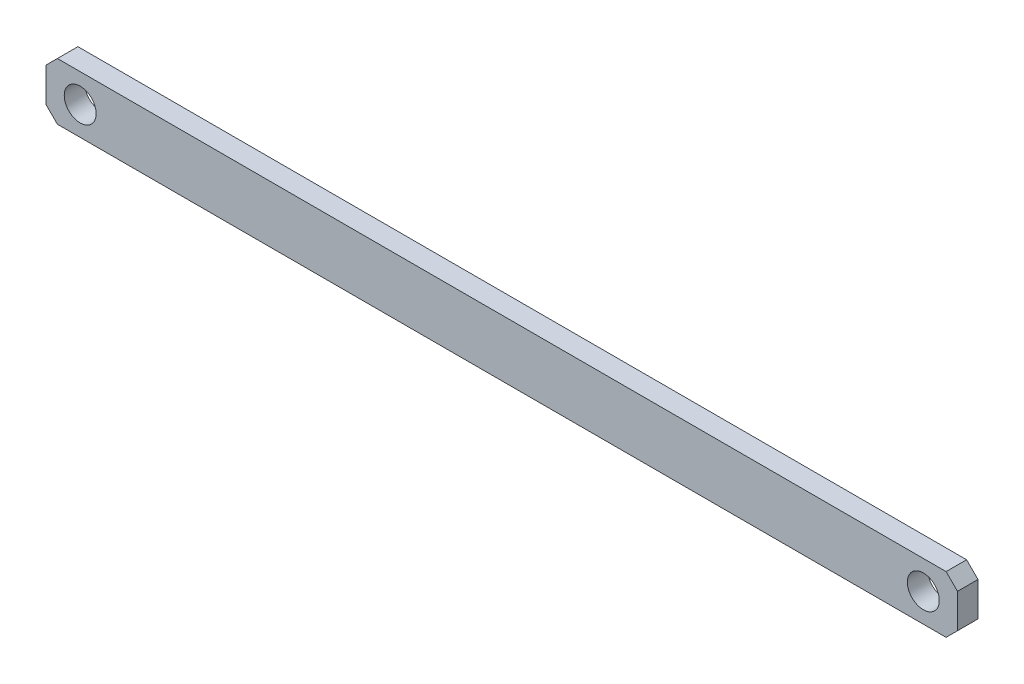
ISO-10303-21;
HEADER;
FILE_DESCRIPTION(('STEP AP214'),'2;1');
FILE_NAME('part.step','',(''),(''),'','','');
FILE_SCHEMA(('AUTOMOTIVE_DESIGN { 1 0 10303 214 1 1 1 1 }'));
ENDSEC;
DATA;
#1=APPLICATION_CONTEXT('core data for automotive mechanical design processes');
#2=APPLICATION_PROTOCOL_DEFINITION('international standard','automotive_design',2000,#1);
#3=PRODUCT_CONTEXT('',#1,'mechanical');
#4=PRODUCT('Part','Part','',(#3));
#5=PRODUCT_RELATED_PRODUCT_CATEGORY('part','',(#4));
#6=PRODUCT_DEFINITION_FORMATION('','',#4);
#7=PRODUCT_DEFINITION_CONTEXT('part definition',#1,'design');
#8=PRODUCT_DEFINITION('design','',#6,#7);
#9=PRODUCT_DEFINITION_SHAPE('','',#8);
#10=(LENGTH_UNIT() NAMED_UNIT(*) SI_UNIT(.MILLI.,.METRE.));
#11=(NAMED_UNIT(*) PLANE_ANGLE_UNIT() SI_UNIT($,.RADIAN.));
#12=(NAMED_UNIT(*) SI_UNIT($,.STERADIAN.) SOLID_ANGLE_UNIT());
#13=UNCERTAINTY_MEASURE_WITH_UNIT(LENGTH_MEASURE(1.E-05),#10,'distance_accuracy_value','');
#14=(GEOMETRIC_REPRESENTATION_CONTEXT(3) GLOBAL_UNCERTAINTY_ASSIGNED_CONTEXT((#13)) GLOBAL_UNIT_ASSIGNED_CONTEXT((#10,
#11,#12)) REPRESENTATION_CONTEXT('',''));
#15=CARTESIAN_POINT('',(0.,0.,0.));
#16=DIRECTION('',(0.,0.,1.));
#17=DIRECTION('',(1.,0.,0.));
#18=AXIS2_PLACEMENT_3D('',#15,#16,#17);
#19=CARTESIAN_POINT('',(0.,0.,4.5));
#20=DIRECTION('',(0.,0.,1.));
#21=DIRECTION('',(1.,0.,0.));
#22=AXIS2_PLACEMENT_3D('',#19,#20,#21);
#23=PLANE('',#22);
#24=CARTESIAN_POINT('',(185.,0.,4.5));
#25=DIRECTION('',(0.,0.,1.));
#26=DIRECTION('',(1.,0.,0.));
#27=AXIS2_PLACEMENT_3D('',#24,#25,#26);
#28=CIRCLE('',#27,7.00000000000001);
#29=CARTESIAN_POINT('',(192.,0.,4.5));
#30=VERTEX_POINT('',#29);
#31=EDGE_CURVE('E134',#30,#30,#28,.T.);
#32=ORIENTED_EDGE('',*,*,#31,.F.);
#33=EDGE_LOOP('',(#32));
#34=FACE_BOUND('',#33,.T.);
#35=DIRECTION('',(-1.,0.,0.));
#36=VECTOR('',#35,1.);
#37=CARTESIAN_POINT('',(-195.,12.5,4.5));
#38=LINE('',#37,#36);
#39=CARTESIAN_POINT('',(195.,12.5,4.5));
#40=VERTEX_POINT('',#39);
#41=CARTESIAN_POINT('',(-195.,12.5,4.5));
#42=VERTEX_POINT('',#41);
#43=EDGE_CURVE('E145',#40,#42,#38,.T.);
#44=ORIENTED_EDGE('',*,*,#43,.T.);
#45=DIRECTION('',(-0.707106781186548,-0.707106781186547,0.));
#46=VECTOR('',#45,1.);
#47=CARTESIAN_POINT('',(-200.,7.5,4.5));
#48=LINE('',#47,#46);
#49=CARTESIAN_POINT('',(-200.,7.5,4.5));
#50=VERTEX_POINT('',#49);
#51=EDGE_CURVE('E93',#42,#50,#48,.T.);
#52=ORIENTED_EDGE('',*,*,#51,.T.);
#53=DIRECTION('',(0.,-1.,0.));
#54=VECTOR('',#53,1.);
#55=CARTESIAN_POINT('',(-200.,-7.5,4.5));
#56=LINE('',#55,#54);
#57=CARTESIAN_POINT('',(-200.,-7.5,4.5));
#58=VERTEX_POINT('',#57);
#59=EDGE_CURVE('E160',#50,#58,#56,.T.);
#60=ORIENTED_EDGE('',*,*,#59,.T.);
#61=DIRECTION('',(0.707106781186548,-0.707106781186547,0.));
#62=VECTOR('',#61,1.);
#63=CARTESIAN_POINT('',(-195.,-12.5,4.5));
#64=LINE('',#63,#62);
#65=CARTESIAN_POINT('',(-195.,-12.5,4.5));
#66=VERTEX_POINT('',#65);
#67=EDGE_CURVE('E173',#58,#66,#64,.T.);
#68=ORIENTED_EDGE('',*,*,#67,.T.);
#69=DIRECTION('',(1.,0.,0.));
#70=VECTOR('',#69,1.);
#71=CARTESIAN_POINT('',(-195.,-12.5,4.5));
#72=LINE('',#71,#70);
#73=CARTESIAN_POINT('',(195.,-12.5,4.5));
#74=VERTEX_POINT('',#73);
#75=EDGE_CURVE('E112',#66,#74,#72,.T.);
#76=ORIENTED_EDGE('',*,*,#75,.T.);
#77=DIRECTION('',(0.707106781186548,0.707106781186547,0.));
#78=VECTOR('',#77,1.);
#79=CARTESIAN_POINT('',(195.,-12.5,4.5));
#80=LINE('',#79,#78);
#81=CARTESIAN_POINT('',(200.,-7.5,4.5));
#82=VERTEX_POINT('',#81);
#83=EDGE_CURVE('E106',#74,#82,#80,.T.);
#84=ORIENTED_EDGE('',*,*,#83,.T.);
#85=DIRECTION('',(0.,1.,0.));
#86=VECTOR('',#85,1.);
#87=CARTESIAN_POINT('',(200.,-7.5,4.5));
#88=LINE('',#87,#86);
#89=CARTESIAN_POINT('',(200.,7.5,4.5));
#90=VERTEX_POINT('',#89);
#91=EDGE_CURVE('E110',#82,#90,#88,.T.);
#92=ORIENTED_EDGE('',*,*,#91,.T.);
#93=DIRECTION('',(-0.707106781186548,0.707106781186547,0.));
#94=VECTOR('',#93,1.);
#95=CARTESIAN_POINT('',(195.,12.5,4.5));
#96=LINE('',#95,#94);
#97=EDGE_CURVE('E50',#90,#40,#96,.T.);
#98=ORIENTED_EDGE('',*,*,#97,.T.);
#99=EDGE_LOOP('',(#44,#52,#60,#68,#76,#84,#92,#98));
#100=FACE_BOUND('',#99,.T.);
#101=CARTESIAN_POINT('',(-185.,0.,4.5));
#102=DIRECTION('',(0.,0.,1.));
#103=DIRECTION('',(-1.,0.,0.));
#104=AXIS2_PLACEMENT_3D('',#101,#102,#103);
#105=CIRCLE('',#104,7.00000000000001);
#106=CARTESIAN_POINT('',(-192.,0.,4.5));
#107=VERTEX_POINT('',#106);
#108=EDGE_CURVE('E182',#107,#107,#105,.T.);
#109=ORIENTED_EDGE('',*,*,#108,.F.);
#110=EDGE_LOOP('',(#109));
#111=FACE_BOUND('',#110,.T.);
#112=ADVANCED_FACE('F33',(#34,#100,#111),#23,.T.);
#113=CARTESIAN_POINT('',(0.,0.,-4.5));
#114=DIRECTION('',(0.,0.,1.));
#115=DIRECTION('',(1.,0.,0.));
#116=AXIS2_PLACEMENT_3D('',#113,#114,#115);
#117=PLANE('',#116);
#118=DIRECTION('',(-1.,0.,0.));
#119=VECTOR('',#118,1.);
#120=CARTESIAN_POINT('',(-195.,12.5,-4.5));
#121=LINE('',#120,#119);
#122=CARTESIAN_POINT('',(195.,12.5,-4.5));
#123=VERTEX_POINT('',#122);
#124=CARTESIAN_POINT('',(-195.,12.5,-4.5));
#125=VERTEX_POINT('',#124);
#126=EDGE_CURVE('E130',#123,#125,#121,.T.);
#127=ORIENTED_EDGE('',*,*,#126,.F.);
#128=DIRECTION('',(-0.707106781186548,0.707106781186547,0.));
#129=VECTOR('',#128,1.);
#130=CARTESIAN_POINT('',(195.,12.5,-4.5));
#131=LINE('',#130,#129);
#132=CARTESIAN_POINT('',(200.,7.5,-4.5));
#133=VERTEX_POINT('',#132);
#134=EDGE_CURVE('E85',#133,#123,#131,.T.);
#135=ORIENTED_EDGE('',*,*,#134,.F.);
#136=DIRECTION('',(0.,1.,0.));
#137=VECTOR('',#136,1.);
#138=CARTESIAN_POINT('',(200.,-7.5,-4.5));
#139=LINE('',#138,#137);
#140=CARTESIAN_POINT('',(200.,-7.5,-4.5));
#141=VERTEX_POINT('',#140);
#142=EDGE_CURVE('E79',#141,#133,#139,.T.);
#143=ORIENTED_EDGE('',*,*,#142,.F.);
#144=DIRECTION('',(0.707106781186548,0.707106781186547,0.));
#145=VECTOR('',#144,1.);
#146=CARTESIAN_POINT('',(195.,-12.5,-4.5));
#147=LINE('',#146,#145);
#148=CARTESIAN_POINT('',(195.,-12.5,-4.5));
#149=VERTEX_POINT('',#148);
#150=EDGE_CURVE('E120',#149,#141,#147,.T.);
#151=ORIENTED_EDGE('',*,*,#150,.F.);
#152=DIRECTION('',(1.,0.,0.));
#153=VECTOR('',#152,1.);
#154=CARTESIAN_POINT('',(-195.,-12.5,-4.5));
#155=LINE('',#154,#153);
#156=CARTESIAN_POINT('',(-195.,-12.5,-4.5));
#157=VERTEX_POINT('',#156);
#158=EDGE_CURVE('E140',#157,#149,#155,.T.);
#159=ORIENTED_EDGE('',*,*,#158,.F.);
#160=DIRECTION('',(0.707106781186548,-0.707106781186547,0.));
#161=VECTOR('',#160,1.);
#162=CARTESIAN_POINT('',(-195.,-12.5,-4.5));
#163=LINE('',#162,#161);
#164=CARTESIAN_POINT('',(-200.,-7.5,-4.5));
#165=VERTEX_POINT('',#164);
#166=EDGE_CURVE('E138',#165,#157,#163,.T.);
#167=ORIENTED_EDGE('',*,*,#166,.F.);
#168=DIRECTION('',(0.,-1.,0.));
#169=VECTOR('',#168,1.);
#170=CARTESIAN_POINT('',(-200.,-7.5,-4.5));
#171=LINE('',#170,#169);
#172=CARTESIAN_POINT('',(-200.,7.5,-4.5));
#173=VERTEX_POINT('',#172);
#174=EDGE_CURVE('E136',#173,#165,#171,.T.);
#175=ORIENTED_EDGE('',*,*,#174,.F.);
#176=DIRECTION('',(-0.707106781186548,-0.707106781186547,0.));
#177=VECTOR('',#176,1.);
#178=CARTESIAN_POINT('',(-200.,7.5,-4.5));
#179=LINE('',#178,#177);
#180=EDGE_CURVE('E133',#125,#173,#179,.T.);
#181=ORIENTED_EDGE('',*,*,#180,.F.);
#182=EDGE_LOOP('',(#127,#135,#143,#151,#159,#167,#175,#181));
#183=FACE_BOUND('',#182,.T.);
#184=CARTESIAN_POINT('',(185.,0.,-4.5));
#185=DIRECTION('',(0.,0.,1.));
#186=DIRECTION('',(1.,0.,0.));
#187=AXIS2_PLACEMENT_3D('',#184,#185,#186);
#188=CIRCLE('',#187,7.00000000000001);
#189=CARTESIAN_POINT('',(192.,0.,-4.5));
#190=VERTEX_POINT('',#189);
#191=EDGE_CURVE('E179',#190,#190,#188,.T.);
#192=ORIENTED_EDGE('',*,*,#191,.T.);
#193=EDGE_LOOP('',(#192));
#194=FACE_BOUND('',#193,.T.);
#195=CARTESIAN_POINT('',(-185.,0.,-4.5));
#196=DIRECTION('',(0.,0.,1.));
#197=DIRECTION('',(-1.,0.,0.));
#198=AXIS2_PLACEMENT_3D('',#195,#196,#197);
#199=CIRCLE('',#198,7.00000000000001);
#200=CARTESIAN_POINT('',(-192.,0.,-4.5));
#201=VERTEX_POINT('',#200);
#202=EDGE_CURVE('E185',#201,#201,#199,.T.);
#203=ORIENTED_EDGE('',*,*,#202,.T.);
#204=EDGE_LOOP('',(#203));
#205=FACE_BOUND('',#204,.T.);
#206=ADVANCED_FACE('F164',(#183,#194,#205),#117,.F.);
#207=CARTESIAN_POINT('',(-195.,12.5,4.5));
#208=DIRECTION('',(0.,-1.,0.));
#209=DIRECTION('',(0.,0.,-1.));
#210=AXIS2_PLACEMENT_3D('',#207,#208,#209);
#211=PLANE('',#210);
#212=ORIENTED_EDGE('',*,*,#126,.T.);
#213=DIRECTION('',(0.,0.,-1.));
#214=VECTOR('',#213,1.);
#215=CARTESIAN_POINT('',(-195.,12.5,4.5));
#216=LINE('',#215,#214);
#217=EDGE_CURVE('E11',#42,#125,#216,.T.);
#218=ORIENTED_EDGE('',*,*,#217,.F.);
#219=ORIENTED_EDGE('',*,*,#43,.F.);
#220=DIRECTION('',(0.,0.,-1.));
#221=VECTOR('',#220,1.);
#222=CARTESIAN_POINT('',(195.,12.5,4.5));
#223=LINE('',#222,#221);
#224=EDGE_CURVE('E126',#40,#123,#223,.T.);
#225=ORIENTED_EDGE('',*,*,#224,.T.);
#226=EDGE_LOOP('',(#212,#218,#219,#225));
#227=FACE_BOUND('',#226,.T.);
#228=ADVANCED_FACE('F35',(#227),#211,.F.);
#229=CARTESIAN_POINT('',(-200.,7.5,4.5));
#230=DIRECTION('',(0.707106781186547,-0.707106781186548,0.));
#231=DIRECTION('',(0.707106781186548,0.707106781186547,0.));
#232=AXIS2_PLACEMENT_3D('',#229,#230,#231);
#233=PLANE('',#232);
#234=ORIENTED_EDGE('',*,*,#180,.T.);
#235=DIRECTION('',(0.,0.,-1.));
#236=VECTOR('',#235,1.);
#237=CARTESIAN_POINT('',(-200.,7.5,4.5));
#238=LINE('',#237,#236);
#239=EDGE_CURVE('E42',#50,#173,#238,.T.);
#240=ORIENTED_EDGE('',*,*,#239,.F.);
#241=ORIENTED_EDGE('',*,*,#51,.F.);
#242=ORIENTED_EDGE('',*,*,#217,.T.);
#243=EDGE_LOOP('',(#234,#240,#241,#242));
#244=FACE_BOUND('',#243,.T.);
#245=ADVANCED_FACE('F217',(#244),#233,.F.);
#246=CARTESIAN_POINT('',(-200.,-7.5,4.5));
#247=DIRECTION('',(1.,0.,0.));
#248=DIRECTION('',(0.,0.,-1.));
#249=AXIS2_PLACEMENT_3D('',#246,#247,#248);
#250=PLANE('',#249);
#251=ORIENTED_EDGE('',*,*,#174,.T.);
#252=DIRECTION('',(0.,0.,-1.));
#253=VECTOR('',#252,1.);
#254=CARTESIAN_POINT('',(-200.,-7.5,4.5));
#255=LINE('',#254,#253);
#256=EDGE_CURVE('E152',#58,#165,#255,.T.);
#257=ORIENTED_EDGE('',*,*,#256,.F.);
#258=ORIENTED_EDGE('',*,*,#59,.F.);
#259=ORIENTED_EDGE('',*,*,#239,.T.);
#260=EDGE_LOOP('',(#251,#257,#258,#259));
#261=FACE_BOUND('',#260,.T.);
#262=ADVANCED_FACE('F158',(#261),#250,.F.);
#263=CARTESIAN_POINT('',(-195.,-12.5,4.5));
#264=DIRECTION('',(0.707106781186547,0.707106781186548,0.));
#265=DIRECTION('',(-0.707106781186548,0.707106781186547,0.));
#266=AXIS2_PLACEMENT_3D('',#263,#264,#265);
#267=PLANE('',#266);
#268=ORIENTED_EDGE('',*,*,#166,.T.);
#269=DIRECTION('',(0.,0.,-1.));
#270=VECTOR('',#269,1.);
#271=CARTESIAN_POINT('',(-195.,-12.5,4.5));
#272=LINE('',#271,#270);
#273=EDGE_CURVE('E149',#66,#157,#272,.T.);
#274=ORIENTED_EDGE('',*,*,#273,.F.);
#275=ORIENTED_EDGE('',*,*,#67,.F.);
#276=ORIENTED_EDGE('',*,*,#256,.T.);
#277=EDGE_LOOP('',(#268,#274,#275,#276));
#278=FACE_BOUND('',#277,.T.);
#279=ADVANCED_FACE('F169',(#278),#267,.F.);
#280=CARTESIAN_POINT('',(-195.,-12.5,4.5));
#281=DIRECTION('',(0.,1.,0.));
#282=DIRECTION('',(0.,0.,1.));
#283=AXIS2_PLACEMENT_3D('',#280,#281,#282);
#284=PLANE('',#283);
#285=ORIENTED_EDGE('',*,*,#158,.T.);
#286=DIRECTION('',(0.,0.,-1.));
#287=VECTOR('',#286,1.);
#288=CARTESIAN_POINT('',(195.,-12.5,4.5));
#289=LINE('',#288,#287);
#290=EDGE_CURVE('E121',#74,#149,#289,.T.);
#291=ORIENTED_EDGE('',*,*,#290,.F.);
#292=ORIENTED_EDGE('',*,*,#75,.F.);
#293=ORIENTED_EDGE('',*,*,#273,.T.);
#294=EDGE_LOOP('',(#285,#291,#292,#293));
#295=FACE_BOUND('',#294,.T.);
#296=ADVANCED_FACE('F172',(#295),#284,.F.);
#297=CARTESIAN_POINT('',(195.,-12.5,4.5));
#298=DIRECTION('',(-0.707106781186547,0.707106781186548,0.));
#299=DIRECTION('',(-0.707106781186548,-0.707106781186547,0.));
#300=AXIS2_PLACEMENT_3D('',#297,#298,#299);
#301=PLANE('',#300);
#302=ORIENTED_EDGE('',*,*,#150,.T.);
#303=DIRECTION('',(0.,0.,-1.));
#304=VECTOR('',#303,1.);
#305=CARTESIAN_POINT('',(200.,-7.5,4.5));
#306=LINE('',#305,#304);
#307=EDGE_CURVE('E117',#82,#141,#306,.T.);
#308=ORIENTED_EDGE('',*,*,#307,.F.);
#309=ORIENTED_EDGE('',*,*,#83,.F.);
#310=ORIENTED_EDGE('',*,*,#290,.T.);
#311=EDGE_LOOP('',(#302,#308,#309,#310));
#312=FACE_BOUND('',#311,.T.);
#313=ADVANCED_FACE('F118',(#312),#301,.F.);
#314=CARTESIAN_POINT('',(200.,-7.5,4.5));
#315=DIRECTION('',(-1.,0.,0.));
#316=DIRECTION('',(0.,0.,1.));
#317=AXIS2_PLACEMENT_3D('',#314,#315,#316);
#318=PLANE('',#317);
#319=ORIENTED_EDGE('',*,*,#142,.T.);
#320=DIRECTION('',(0.,0.,-1.));
#321=VECTOR('',#320,1.);
#322=CARTESIAN_POINT('',(200.,7.5,4.5));
#323=LINE('',#322,#321);
#324=EDGE_CURVE('E122',#90,#133,#323,.T.);
#325=ORIENTED_EDGE('',*,*,#324,.F.);
#326=ORIENTED_EDGE('',*,*,#91,.F.);
#327=ORIENTED_EDGE('',*,*,#307,.T.);
#328=EDGE_LOOP('',(#319,#325,#326,#327));
#329=FACE_BOUND('',#328,.T.);
#330=ADVANCED_FACE('F124',(#329),#318,.F.);
#331=CARTESIAN_POINT('',(195.,12.5,4.5));
#332=DIRECTION('',(-0.707106781186547,-0.707106781186548,0.));
#333=DIRECTION('',(0.707106781186548,-0.707106781186547,0.));
#334=AXIS2_PLACEMENT_3D('',#331,#332,#333);
#335=PLANE('',#334);
#336=ORIENTED_EDGE('',*,*,#134,.T.);
#337=ORIENTED_EDGE('',*,*,#224,.F.);
#338=ORIENTED_EDGE('',*,*,#97,.F.);
#339=ORIENTED_EDGE('',*,*,#324,.T.);
#340=EDGE_LOOP('',(#336,#337,#338,#339));
#341=FACE_BOUND('',#340,.T.);
#342=ADVANCED_FACE('F205',(#341),#335,.F.);
#343=CARTESIAN_POINT('',(185.,0.,4.5));
#344=DIRECTION('',(0.,0.,-1.));
#345=DIRECTION('',(-1.,0.,0.));
#346=AXIS2_PLACEMENT_3D('',#343,#344,#345);
#347=CYLINDRICAL_SURFACE('',#346,7.00000000000001);
#348=ORIENTED_EDGE('',*,*,#31,.T.);
#349=EDGE_LOOP('',(#348));
#350=FACE_BOUND('',#349,.T.);
#351=ORIENTED_EDGE('',*,*,#191,.F.);
#352=EDGE_LOOP('',(#351));
#353=FACE_BOUND('',#352,.T.);
#354=ADVANCED_FACE('F202',(#350,#353),#347,.F.);
#355=CARTESIAN_POINT('',(-185.,0.,4.5));
#356=DIRECTION('',(0.,0.,-1.));
#357=DIRECTION('',(-1.,0.,0.));
#358=AXIS2_PLACEMENT_3D('',#355,#356,#357);
#359=CYLINDRICAL_SURFACE('',#358,7.00000000000001);
#360=ORIENTED_EDGE('',*,*,#108,.T.);
#361=EDGE_LOOP('',(#360));
#362=FACE_BOUND('',#361,.T.);
#363=ORIENTED_EDGE('',*,*,#202,.F.);
#364=EDGE_LOOP('',(#363));
#365=FACE_BOUND('',#364,.T.);
#366=ADVANCED_FACE('F191',(#362,#365),#359,.F.);
#367=CLOSED_SHELL('',(#112,#206,#228,#245,#262,#279,#296,#313,#330,#342,#354,#366));
#368=MANIFOLD_SOLID_BREP('B2',#367);
#369=ADVANCED_BREP_SHAPE_REPRESENTATION('',(#18,#368),#14);
#370=SHAPE_DEFINITION_REPRESENTATION(#9,#369);
ENDSEC;
END-ISO-10303-21;
